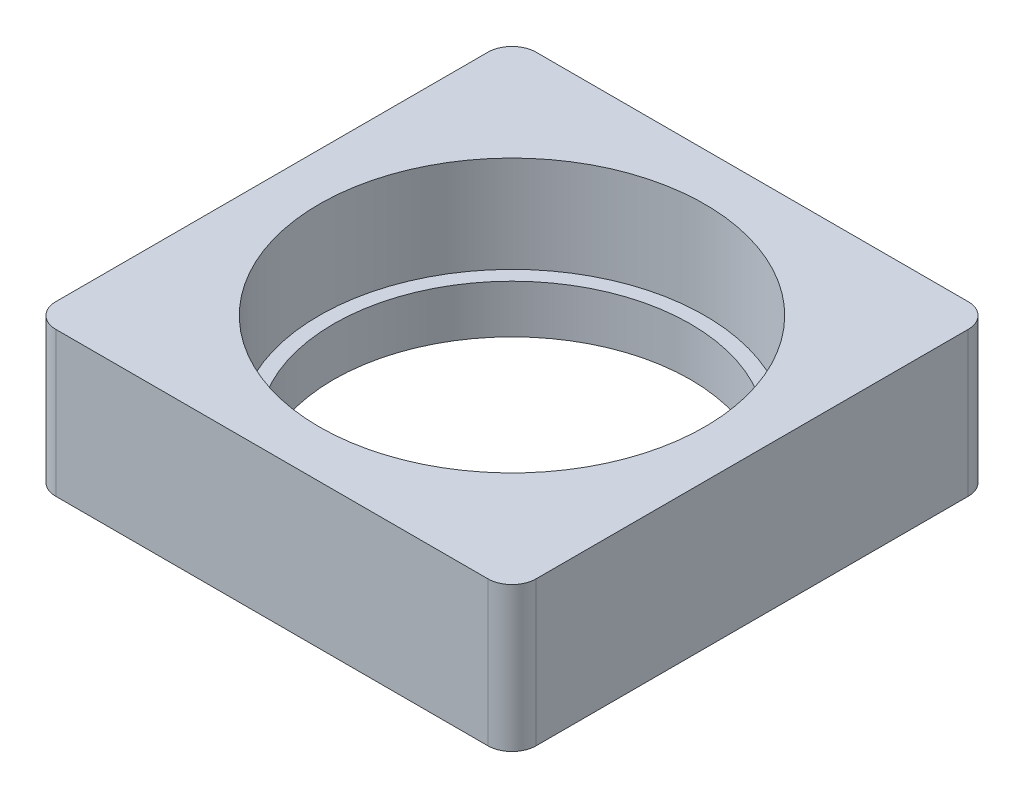
ISO-10303-21;
HEADER;
FILE_DESCRIPTION(('STEP AP214'),'2;1');
FILE_NAME('part.step','',(''),(''),'','','');
FILE_SCHEMA(('AUTOMOTIVE_DESIGN { 1 0 10303 214 1 1 1 1 }'));
ENDSEC;
DATA;
#1=APPLICATION_CONTEXT('core data for automotive mechanical design processes');
#2=APPLICATION_PROTOCOL_DEFINITION('international standard','automotive_design',2000,#1);
#3=PRODUCT_CONTEXT('',#1,'mechanical');
#4=PRODUCT('Part','Part','',(#3));
#5=PRODUCT_RELATED_PRODUCT_CATEGORY('part','',(#4));
#6=PRODUCT_DEFINITION_FORMATION('','',#4);
#7=PRODUCT_DEFINITION_CONTEXT('part definition',#1,'design');
#8=PRODUCT_DEFINITION('design','',#6,#7);
#9=PRODUCT_DEFINITION_SHAPE('','',#8);
#10=(LENGTH_UNIT() NAMED_UNIT(*) SI_UNIT(.MILLI.,.METRE.));
#11=(NAMED_UNIT(*) PLANE_ANGLE_UNIT() SI_UNIT($,.RADIAN.));
#12=(NAMED_UNIT(*) SI_UNIT($,.STERADIAN.) SOLID_ANGLE_UNIT());
#13=UNCERTAINTY_MEASURE_WITH_UNIT(LENGTH_MEASURE(1.E-05),#10,'distance_accuracy_value','');
#14=(GEOMETRIC_REPRESENTATION_CONTEXT(3) GLOBAL_UNCERTAINTY_ASSIGNED_CONTEXT((#13)) GLOBAL_UNIT_ASSIGNED_CONTEXT((#10,
#11,#12)) REPRESENTATION_CONTEXT('',''));
#15=CARTESIAN_POINT('',(0.,0.,0.));
#16=DIRECTION('',(0.,0.,1.));
#17=DIRECTION('',(1.,0.,0.));
#18=AXIS2_PLACEMENT_3D('',#15,#16,#17);
#19=CARTESIAN_POINT('',(1.5748,4.7625,-4.572));
#20=DIRECTION('',(-1.,0.,0.));
#21=DIRECTION('',(0.,0.,1.));
#22=AXIS2_PLACEMENT_3D('',#19,#20,#21);
#23=PLANE('',#22);
#24=CARTESIAN_POINT('',(1.5748,4.7625,-4.572));
#25=DIRECTION('',(-1.,0.,0.));
#26=DIRECTION('',(0.,0.,1.));
#27=AXIS2_PLACEMENT_3D('',#24,#25,#26);
#28=CIRCLE('',#27,3.1623);
#29=CARTESIAN_POINT('',(1.5748,4.7625,-1.4097));
#30=VERTEX_POINT('',#29);
#31=EDGE_CURVE('E236',#30,#30,#28,.T.);
#32=ORIENTED_EDGE('',*,*,#31,.T.);
#33=EDGE_LOOP('',(#32));
#34=FACE_BOUND('',#33,.T.);
#35=ADVANCED_FACE('F16',(#34),#23,.T.);
#36=CARTESIAN_POINT('',(15.8115,-35.9210244842766,-15.8115));
#37=DIRECTION('',(0.,1.,0.));
#38=DIRECTION('',(0.,0.,1.));
#39=AXIS2_PLACEMENT_3D('',#36,#37,#38);
#40=CYLINDRICAL_SURFACE('',#39,12.7);
#41=CARTESIAN_POINT('',(15.8115,3.175,-15.8115));
#42=DIRECTION('',(0.,1.,0.));
#43=DIRECTION('',(0.,0.,1.));
#44=AXIS2_PLACEMENT_3D('',#41,#42,#43);
#45=CIRCLE('',#44,12.7);
#46=CARTESIAN_POINT('',(15.8115,3.175,-3.1115));
#47=VERTEX_POINT('',#46);
#48=EDGE_CURVE('E19',#47,#47,#45,.F.);
#49=ORIENTED_EDGE('',*,*,#48,.T.);
#50=EDGE_LOOP('',(#49));
#51=FACE_BOUND('',#50,.T.);
#52=CARTESIAN_POINT('',(15.8115,9.525,-15.8115));
#53=DIRECTION('',(0.,1.,0.));
#54=DIRECTION('',(0.,0.,1.));
#55=AXIS2_PLACEMENT_3D('',#52,#53,#54);
#56=CIRCLE('',#55,12.7);
#57=CARTESIAN_POINT('',(15.8115,9.525,-3.1115));
#58=VERTEX_POINT('',#57);
#59=EDGE_CURVE('E238',#58,#58,#56,.T.);
#60=ORIENTED_EDGE('',*,*,#59,.T.);
#61=EDGE_LOOP('',(#60));
#62=FACE_BOUND('',#61,.T.);
#63=ADVANCED_FACE('F248',(#51,#62),#40,.F.);
#64=CARTESIAN_POINT('',(0.,3.175,0.));
#65=DIRECTION('',(0.,-1.,0.));
#66=DIRECTION('',(0.,0.,-1.));
#67=AXIS2_PLACEMENT_3D('',#64,#65,#66);
#68=PLANE('',#67);
#69=CARTESIAN_POINT('',(15.8115,3.175,-15.8115));
#70=DIRECTION('',(0.,1.,0.));
#71=DIRECTION('',(0.,0.,1.));
#72=AXIS2_PLACEMENT_3D('',#69,#70,#71);
#73=CIRCLE('',#72,11.7475);
#74=CARTESIAN_POINT('',(15.8115,3.175,-4.064));
#75=VERTEX_POINT('',#74);
#76=EDGE_CURVE('E122',#75,#75,#73,.F.);
#77=ORIENTED_EDGE('',*,*,#76,.T.);
#78=EDGE_LOOP('',(#77));
#79=FACE_BOUND('',#78,.T.);
#80=ORIENTED_EDGE('',*,*,#48,.F.);
#81=EDGE_LOOP('',(#80));
#82=FACE_BOUND('',#81,.T.);
#83=ADVANCED_FACE('F193',(#79,#82),#68,.F.);
#84=CARTESIAN_POINT('',(1.5748,4.7625,-4.572));
#85=DIRECTION('',(-1.,0.,0.));
#86=DIRECTION('',(0.,0.,1.));
#87=AXIS2_PLACEMENT_3D('',#84,#85,#86);
#88=CYLINDRICAL_SURFACE('',#87,3.1623);
#89=CARTESIAN_POINT('',(0.,4.7625,-4.572));
#90=DIRECTION('',(-1.,0.,0.));
#91=DIRECTION('',(0.,0.,1.));
#92=AXIS2_PLACEMENT_3D('',#89,#90,#91);
#93=CIRCLE('',#92,3.1623);
#94=CARTESIAN_POINT('',(0.,5.80791907386464,-1.5875));
#95=VERTEX_POINT('',#94);
#96=CARTESIAN_POINT('',(0.,3.71708092613536,-1.5875));
#97=VERTEX_POINT('',#96);
#98=EDGE_CURVE('E144',#95,#97,#93,.T.);
#99=ORIENTED_EDGE('',*,*,#98,.T.);
#100=CARTESIAN_POINT('',(0.,5.80791907386464,-1.5875));
#101=CARTESIAN_POINT('',(2.21469381864389E-06,5.76543072385641,-1.57261710446023));
#102=CARTESIAN_POINT('',(0.000208960677507276,5.72263085381354,-1.55864380412265));
#103=CARTESIAN_POINT('',(0.000897624958865748,5.63647642581595,-1.53253737760836));
#104=CARTESIAN_POINT('',(0.00137953822386666,5.59312187802019,-1.52040421778156));
#105=CARTESIAN_POINT('',(0.00303694623328012,5.46234767019402,-1.48680112376522));
#106=CARTESIAN_POINT('',(0.00442424096767263,5.374196644088,-1.4681202917167));
#107=CARTESIAN_POINT('',(0.00691701924513229,5.19908724564886,-1.43875921328412));
#108=CARTESIAN_POINT('',(0.00802923257560603,5.11216325983567,-1.42787208949064));
#109=CARTESIAN_POINT('',(0.00956457345174745,4.93770899313758,-1.4133448523383));
#110=CARTESIAN_POINT('',(0.00998776089574341,4.85017876561883,-1.4097041090317));
#111=CARTESIAN_POINT('',(0.00998868227418239,4.67509393769335,-1.40969589680216));
#112=CARTESIAN_POINT('',(0.0095661843419069,4.58753933718492,-1.41333042258415));
#113=CARTESIAN_POINT('',(0.00803156157409693,4.41303611404772,-1.42784925211999));
#114=CARTESIAN_POINT('',(0.00691937644476932,4.32608754507152,-1.43873418972509));
#115=CARTESIAN_POINT('',(0.00442614760161724,4.15092792044109,-1.46809500897624));
#116=CARTESIAN_POINT('',(0.0030383580623584,4.06275126975242,-1.48677794109248));
#117=CARTESIAN_POINT('',(0.00138023691170389,3.93193933726919,-1.52038736834083));
#118=CARTESIAN_POINT('',(0.00089809078376427,3.88857233703908,-1.53252316845373));
#119=CARTESIAN_POINT('',(0.000209078381713718,3.80239329523531,-1.55863592020701));
#120=CARTESIAN_POINT('',(2.21714094926195E-06,3.75958126382295,-1.57261290550673));
#121=CARTESIAN_POINT('',(0.,3.71708092613536,-1.5875));
#122=B_SPLINE_CURVE_WITH_KNOTS('',3,(#100,#101,#102,#103,#104,#105,#106,#107,#108,#109,#110,
#111,#112,#113,#114,#115,#116,#117,#118,#119,#120,#121),.UNSPECIFIED.,.F.,.F.,(4,2,2,2,2,2,2,2,
2,2,4),(0.,0.135035182475541,0.270067895305719,0.540067419621777,0.802603660730558,
1.06511707784674,1.32770247972674,1.59031084056897,1.8603865825587,1.99545738041359,
2.13053064788746),.UNSPECIFIED.);
#123=EDGE_CURVE('E120',#95,#97,#122,.T.);
#124=ORIENTED_EDGE('',*,*,#123,.F.);
#125=EDGE_LOOP('',(#99,#124));
#126=FACE_BOUND('',#125,.T.);
#127=ORIENTED_EDGE('',*,*,#31,.F.);
#128=EDGE_LOOP('',(#127));
#129=FACE_BOUND('',#128,.T.);
#130=ADVANCED_FACE('F157',(#126,#129),#88,.F.);
#131=CARTESIAN_POINT('',(0.,9.525,0.));
#132=DIRECTION('',(0.,-1.,0.));
#133=DIRECTION('',(0.,0.,-1.));
#134=AXIS2_PLACEMENT_3D('',#131,#132,#133);
#135=PLANE('',#134);
#136=CARTESIAN_POINT('',(30.0355,9.525,-30.0355));
#137=DIRECTION('',(0.,-1.,0.));
#138=DIRECTION('',(0.,0.,-1.));
#139=AXIS2_PLACEMENT_3D('',#136,#137,#138);
#140=CIRCLE('',#139,1.5875);
#141=CARTESIAN_POINT('',(30.0355,9.525,-31.623));
#142=VERTEX_POINT('',#141);
#143=CARTESIAN_POINT('',(31.623,9.525,-30.0355));
#144=VERTEX_POINT('',#143);
#145=EDGE_CURVE('E85',#142,#144,#140,.T.);
#146=ORIENTED_EDGE('',*,*,#145,.F.);
#147=DIRECTION('',(1.,0.,0.));
#148=VECTOR('',#147,1.);
#149=CARTESIAN_POINT('',(0.,9.525,-31.623));
#150=LINE('',#149,#148);
#151=CARTESIAN_POINT('',(1.5875,9.525,-31.623));
#152=VERTEX_POINT('',#151);
#153=EDGE_CURVE('E104',#142,#152,#150,.F.);
#154=ORIENTED_EDGE('',*,*,#153,.T.);
#155=CARTESIAN_POINT('',(1.5875,9.525,-30.0355));
#156=DIRECTION('',(0.,-1.,0.));
#157=DIRECTION('',(0.,0.,-1.));
#158=AXIS2_PLACEMENT_3D('',#155,#156,#157);
#159=CIRCLE('',#158,1.5875);
#160=CARTESIAN_POINT('',(0.,9.525,-30.0355));
#161=VERTEX_POINT('',#160);
#162=EDGE_CURVE('E139',#161,#152,#159,.T.);
#163=ORIENTED_EDGE('',*,*,#162,.F.);
#164=DIRECTION('',(0.,0.,-1.));
#165=VECTOR('',#164,1.);
#166=CARTESIAN_POINT('',(0.,9.525,0.));
#167=LINE('',#166,#165);
#168=CARTESIAN_POINT('',(0.,9.525,-1.5875));
#169=VERTEX_POINT('',#168);
#170=EDGE_CURVE('E117',#161,#169,#167,.F.);
#171=ORIENTED_EDGE('',*,*,#170,.T.);
#172=CARTESIAN_POINT('',(1.5875,9.525,-1.5875));
#173=DIRECTION('',(0.,-1.,0.));
#174=DIRECTION('',(0.,0.,-1.));
#175=AXIS2_PLACEMENT_3D('',#172,#173,#174);
#176=CIRCLE('',#175,1.5875);
#177=CARTESIAN_POINT('',(1.5875,9.525,0.));
#178=VERTEX_POINT('',#177);
#179=EDGE_CURVE('E148',#178,#169,#176,.T.);
#180=ORIENTED_EDGE('',*,*,#179,.F.);
#181=DIRECTION('',(-1.,0.,0.));
#182=VECTOR('',#181,1.);
#183=CARTESIAN_POINT('',(0.,9.525,0.));
#184=LINE('',#183,#182);
#185=CARTESIAN_POINT('',(30.0355,9.525,0.));
#186=VERTEX_POINT('',#185);
#187=EDGE_CURVE('E123',#178,#186,#184,.F.);
#188=ORIENTED_EDGE('',*,*,#187,.T.);
#189=CARTESIAN_POINT('',(30.0355,9.525,-1.5875));
#190=DIRECTION('',(0.,-1.,0.));
#191=DIRECTION('',(0.,0.,-1.));
#192=AXIS2_PLACEMENT_3D('',#189,#190,#191);
#193=CIRCLE('',#192,1.5875);
#194=CARTESIAN_POINT('',(31.623,9.525,-1.5875));
#195=VERTEX_POINT('',#194);
#196=EDGE_CURVE('E92',#195,#186,#193,.T.);
#197=ORIENTED_EDGE('',*,*,#196,.F.);
#198=DIRECTION('',(0.,0.,1.));
#199=VECTOR('',#198,1.);
#200=CARTESIAN_POINT('',(31.623,9.525,0.));
#201=LINE('',#200,#199);
#202=EDGE_CURVE('E88',#195,#144,#201,.F.);
#203=ORIENTED_EDGE('',*,*,#202,.T.);
#204=EDGE_LOOP('',(#146,#154,#163,#171,#180,#188,#197,#203));
#205=FACE_BOUND('',#204,.T.);
#206=ORIENTED_EDGE('',*,*,#59,.F.);
#207=EDGE_LOOP('',(#206));
#208=FACE_BOUND('',#207,.T.);
#209=ADVANCED_FACE('F89',(#205,#208),#135,.F.);
#210=CARTESIAN_POINT('',(15.8115,0.,-15.8115));
#211=DIRECTION('',(0.,1.,0.));
#212=DIRECTION('',(0.,0.,1.));
#213=AXIS2_PLACEMENT_3D('',#210,#211,#212);
#214=CYLINDRICAL_SURFACE('',#213,11.7475);
#215=ORIENTED_EDGE('',*,*,#76,.F.);
#216=EDGE_LOOP('',(#215));
#217=FACE_BOUND('',#216,.T.);
#218=CARTESIAN_POINT('',(15.8115,0.,-15.8115));
#219=DIRECTION('',(0.,1.,0.));
#220=DIRECTION('',(0.,0.,1.));
#221=AXIS2_PLACEMENT_3D('',#218,#219,#220);
#222=CIRCLE('',#221,11.7475);
#223=CARTESIAN_POINT('',(15.8115,0.,-4.064));
#224=VERTEX_POINT('',#223);
#225=EDGE_CURVE('E136',#224,#224,#222,.T.);
#226=ORIENTED_EDGE('',*,*,#225,.F.);
#227=EDGE_LOOP('',(#226));
#228=FACE_BOUND('',#227,.T.);
#229=ADVANCED_FACE('F184',(#217,#228),#214,.F.);
#230=CARTESIAN_POINT('',(0.,9.525,-31.623));
#231=DIRECTION('',(0.,0.,1.));
#232=DIRECTION('',(1.,0.,0.));
#233=AXIS2_PLACEMENT_3D('',#230,#231,#232);
#234=PLANE('',#233);
#235=DIRECTION('',(0.,-1.,0.));
#236=VECTOR('',#235,1.);
#237=CARTESIAN_POINT('',(30.0355,9.525,-31.623));
#238=LINE('',#237,#236);
#239=CARTESIAN_POINT('',(30.0355,0.,-31.623));
#240=VERTEX_POINT('',#239);
#241=EDGE_CURVE('E97',#240,#142,#238,.F.);
#242=ORIENTED_EDGE('',*,*,#241,.F.);
#243=DIRECTION('',(1.,0.,0.));
#244=VECTOR('',#243,1.);
#245=CARTESIAN_POINT('',(0.,0.,-31.623));
#246=LINE('',#245,#244);
#247=CARTESIAN_POINT('',(1.5875,0.,-31.623));
#248=VERTEX_POINT('',#247);
#249=EDGE_CURVE('E135',#248,#240,#246,.T.);
#250=ORIENTED_EDGE('',*,*,#249,.F.);
#251=DIRECTION('',(0.,-1.,0.));
#252=VECTOR('',#251,1.);
#253=CARTESIAN_POINT('',(1.5875,9.525,-31.623));
#254=LINE('',#253,#252);
#255=EDGE_CURVE('E142',#152,#248,#254,.T.);
#256=ORIENTED_EDGE('',*,*,#255,.F.);
#257=ORIENTED_EDGE('',*,*,#153,.F.);
#258=EDGE_LOOP('',(#242,#250,#256,#257));
#259=FACE_BOUND('',#258,.T.);
#260=ADVANCED_FACE('F181',(#259),#234,.F.);
#261=CARTESIAN_POINT('',(30.0355,9.525,-30.0355));
#262=DIRECTION('',(0.,-1.,0.));
#263=DIRECTION('',(0.,0.,-1.));
#264=AXIS2_PLACEMENT_3D('',#261,#262,#263);
#265=CYLINDRICAL_SURFACE('',#264,1.5875);
#266=CARTESIAN_POINT('',(30.0355,0.,-30.0355));
#267=DIRECTION('',(0.,-1.,0.));
#268=DIRECTION('',(0.,0.,-1.));
#269=AXIS2_PLACEMENT_3D('',#266,#267,#268);
#270=CIRCLE('',#269,1.5875);
#271=CARTESIAN_POINT('',(31.623,0.,-30.0355));
#272=VERTEX_POINT('',#271);
#273=EDGE_CURVE('E133',#240,#272,#270,.T.);
#274=ORIENTED_EDGE('',*,*,#273,.F.);
#275=ORIENTED_EDGE('',*,*,#241,.T.);
#276=ORIENTED_EDGE('',*,*,#145,.T.);
#277=DIRECTION('',(0.,1.,0.));
#278=VECTOR('',#277,1.);
#279=CARTESIAN_POINT('',(31.623,9.525,-30.0355));
#280=LINE('',#279,#278);
#281=EDGE_CURVE('E96',#144,#272,#280,.F.);
#282=ORIENTED_EDGE('',*,*,#281,.T.);
#283=EDGE_LOOP('',(#274,#275,#276,#282));
#284=FACE_BOUND('',#283,.T.);
#285=ADVANCED_FACE('F102',(#284),#265,.T.);
#286=CARTESIAN_POINT('',(31.623,9.525,0.));
#287=DIRECTION('',(-1.,0.,0.));
#288=DIRECTION('',(0.,0.,1.));
#289=AXIS2_PLACEMENT_3D('',#286,#287,#288);
#290=PLANE('',#289);
#291=ORIENTED_EDGE('',*,*,#281,.F.);
#292=ORIENTED_EDGE('',*,*,#202,.F.);
#293=DIRECTION('',(0.,-1.,0.));
#294=VECTOR('',#293,1.);
#295=CARTESIAN_POINT('',(31.623,9.525,-1.5875));
#296=LINE('',#295,#294);
#297=CARTESIAN_POINT('',(31.623,0.,-1.5875));
#298=VERTEX_POINT('',#297);
#299=EDGE_CURVE('E111',#298,#195,#296,.F.);
#300=ORIENTED_EDGE('',*,*,#299,.F.);
#301=DIRECTION('',(0.,0.,-1.));
#302=VECTOR('',#301,1.);
#303=CARTESIAN_POINT('',(31.623,0.,0.));
#304=LINE('',#303,#302);
#305=EDGE_CURVE('E108',#272,#298,#304,.F.);
#306=ORIENTED_EDGE('',*,*,#305,.F.);
#307=EDGE_LOOP('',(#291,#292,#300,#306));
#308=FACE_BOUND('',#307,.T.);
#309=ADVANCED_FACE('F106',(#308),#290,.F.);
#310=CARTESIAN_POINT('',(30.0355,9.525,-1.5875));
#311=DIRECTION('',(0.,-1.,0.));
#312=DIRECTION('',(0.,0.,-1.));
#313=AXIS2_PLACEMENT_3D('',#310,#311,#312);
#314=CYLINDRICAL_SURFACE('',#313,1.5875);
#315=CARTESIAN_POINT('',(30.0355,0.,-1.5875));
#316=DIRECTION('',(0.,-1.,0.));
#317=DIRECTION('',(0.,0.,-1.));
#318=AXIS2_PLACEMENT_3D('',#315,#316,#317);
#319=CIRCLE('',#318,1.5875);
#320=CARTESIAN_POINT('',(30.0355,0.,0.));
#321=VERTEX_POINT('',#320);
#322=EDGE_CURVE('E130',#298,#321,#319,.T.);
#323=ORIENTED_EDGE('',*,*,#322,.F.);
#324=ORIENTED_EDGE('',*,*,#299,.T.);
#325=ORIENTED_EDGE('',*,*,#196,.T.);
#326=DIRECTION('',(0.,1.,0.));
#327=VECTOR('',#326,1.);
#328=CARTESIAN_POINT('',(30.0355,9.525,0.));
#329=LINE('',#328,#327);
#330=EDGE_CURVE('E124',#186,#321,#329,.F.);
#331=ORIENTED_EDGE('',*,*,#330,.T.);
#332=EDGE_LOOP('',(#323,#324,#325,#331));
#333=FACE_BOUND('',#332,.T.);
#334=ADVANCED_FACE('F172',(#333),#314,.T.);
#335=CARTESIAN_POINT('',(0.,9.525,0.));
#336=DIRECTION('',(0.,0.,-1.));
#337=DIRECTION('',(-1.,0.,0.));
#338=AXIS2_PLACEMENT_3D('',#335,#336,#337);
#339=PLANE('',#338);
#340=ORIENTED_EDGE('',*,*,#330,.F.);
#341=ORIENTED_EDGE('',*,*,#187,.F.);
#342=DIRECTION('',(0.,-1.,0.));
#343=VECTOR('',#342,1.);
#344=CARTESIAN_POINT('',(1.5875,9.525,0.));
#345=LINE('',#344,#343);
#346=CARTESIAN_POINT('',(1.5875,0.,0.));
#347=VERTEX_POINT('',#346);
#348=EDGE_CURVE('E223',#347,#178,#345,.F.);
#349=ORIENTED_EDGE('',*,*,#348,.F.);
#350=DIRECTION('',(1.,0.,0.));
#351=VECTOR('',#350,1.);
#352=CARTESIAN_POINT('',(0.,0.,0.));
#353=LINE('',#352,#351);
#354=EDGE_CURVE('E129',#321,#347,#353,.F.);
#355=ORIENTED_EDGE('',*,*,#354,.F.);
#356=EDGE_LOOP('',(#340,#341,#349,#355));
#357=FACE_BOUND('',#356,.T.);
#358=ADVANCED_FACE('F167',(#357),#339,.F.);
#359=CARTESIAN_POINT('',(1.5875,9.525,-1.5875));
#360=DIRECTION('',(0.,-1.,0.));
#361=DIRECTION('',(0.,0.,-1.));
#362=AXIS2_PLACEMENT_3D('',#359,#360,#361);
#363=CYLINDRICAL_SURFACE('',#362,1.5875);
#364=DIRECTION('',(0.,1.,0.));
#365=VECTOR('',#364,1.);
#366=CARTESIAN_POINT('',(0.,9.525,-1.5875));
#367=LINE('',#366,#365);
#368=EDGE_CURVE('E119',#169,#95,#367,.F.);
#369=ORIENTED_EDGE('',*,*,#368,.T.);
#370=ORIENTED_EDGE('',*,*,#123,.T.);
#371=DIRECTION('',(0.,1.,0.));
#372=VECTOR('',#371,1.);
#373=CARTESIAN_POINT('',(0.,9.525,-1.5875));
#374=LINE('',#373,#372);
#375=CARTESIAN_POINT('',(0.,0.,-1.5875));
#376=VERTEX_POINT('',#375);
#377=EDGE_CURVE('E143',#97,#376,#374,.F.);
#378=ORIENTED_EDGE('',*,*,#377,.T.);
#379=CARTESIAN_POINT('',(1.5875,0.,-1.5875));
#380=DIRECTION('',(0.,-1.,0.));
#381=DIRECTION('',(0.,0.,-1.));
#382=AXIS2_PLACEMENT_3D('',#379,#380,#381);
#383=CIRCLE('',#382,1.5875);
#384=EDGE_CURVE('E126',#347,#376,#383,.T.);
#385=ORIENTED_EDGE('',*,*,#384,.F.);
#386=ORIENTED_EDGE('',*,*,#348,.T.);
#387=ORIENTED_EDGE('',*,*,#179,.T.);
#388=EDGE_LOOP('',(#369,#370,#378,#385,#386,#387));
#389=FACE_BOUND('',#388,.T.);
#390=ADVANCED_FACE('F161',(#389),#363,.T.);
#391=CARTESIAN_POINT('',(0.,9.525,0.));
#392=DIRECTION('',(1.,0.,0.));
#393=DIRECTION('',(0.,0.,-1.));
#394=AXIS2_PLACEMENT_3D('',#391,#392,#393);
#395=PLANE('',#394);
#396=ORIENTED_EDGE('',*,*,#98,.F.);
#397=ORIENTED_EDGE('',*,*,#368,.F.);
#398=ORIENTED_EDGE('',*,*,#170,.F.);
#399=DIRECTION('',(0.,-1.,0.));
#400=VECTOR('',#399,1.);
#401=CARTESIAN_POINT('',(0.,9.525,-30.0355));
#402=LINE('',#401,#400);
#403=CARTESIAN_POINT('',(0.,0.,-30.0355));
#404=VERTEX_POINT('',#403);
#405=EDGE_CURVE('E34',#404,#161,#402,.F.);
#406=ORIENTED_EDGE('',*,*,#405,.F.);
#407=DIRECTION('',(0.,0.,-1.));
#408=VECTOR('',#407,1.);
#409=CARTESIAN_POINT('',(0.,0.,0.));
#410=LINE('',#409,#408);
#411=EDGE_CURVE('E25',#376,#404,#410,.T.);
#412=ORIENTED_EDGE('',*,*,#411,.F.);
#413=ORIENTED_EDGE('',*,*,#377,.F.);
#414=EDGE_LOOP('',(#396,#397,#398,#406,#412,#413));
#415=FACE_BOUND('',#414,.T.);
#416=ADVANCED_FACE('F166',(#415),#395,.F.);
#417=CARTESIAN_POINT('',(1.5875,9.525,-30.0355));
#418=DIRECTION('',(0.,-1.,0.));
#419=DIRECTION('',(0.,0.,-1.));
#420=AXIS2_PLACEMENT_3D('',#417,#418,#419);
#421=CYLINDRICAL_SURFACE('',#420,1.5875);
#422=CARTESIAN_POINT('',(1.5875,0.,-30.0355));
#423=DIRECTION('',(0.,-1.,0.));
#424=DIRECTION('',(0.,0.,-1.));
#425=AXIS2_PLACEMENT_3D('',#422,#423,#424);
#426=CIRCLE('',#425,1.5875);
#427=EDGE_CURVE('E11',#404,#248,#426,.T.);
#428=ORIENTED_EDGE('',*,*,#427,.F.);
#429=ORIENTED_EDGE('',*,*,#405,.T.);
#430=ORIENTED_EDGE('',*,*,#162,.T.);
#431=ORIENTED_EDGE('',*,*,#255,.T.);
#432=EDGE_LOOP('',(#428,#429,#430,#431));
#433=FACE_BOUND('',#432,.T.);
#434=ADVANCED_FACE('F197',(#433),#421,.T.);
#435=CARTESIAN_POINT('',(0.,0.,0.));
#436=DIRECTION('',(0.,-1.,0.));
#437=DIRECTION('',(0.,0.,-1.));
#438=AXIS2_PLACEMENT_3D('',#435,#436,#437);
#439=PLANE('',#438);
#440=ORIENTED_EDGE('',*,*,#411,.T.);
#441=ORIENTED_EDGE('',*,*,#427,.T.);
#442=ORIENTED_EDGE('',*,*,#249,.T.);
#443=ORIENTED_EDGE('',*,*,#273,.T.);
#444=ORIENTED_EDGE('',*,*,#305,.T.);
#445=ORIENTED_EDGE('',*,*,#322,.T.);
#446=ORIENTED_EDGE('',*,*,#354,.T.);
#447=ORIENTED_EDGE('',*,*,#384,.T.);
#448=EDGE_LOOP('',(#440,#441,#442,#443,#444,#445,#446,#447));
#449=FACE_BOUND('',#448,.T.);
#450=ORIENTED_EDGE('',*,*,#225,.T.);
#451=EDGE_LOOP('',(#450));
#452=FACE_BOUND('',#451,.T.);
#453=ADVANCED_FACE('F195',(#449,#452),#439,.T.);
#454=CLOSED_SHELL('',(#35,#63,#83,#130,#209,#229,#260,#285,#309,#334,#358,#390,#416,#434,#453));
#455=MANIFOLD_SOLID_BREP('B1',#454);
#456=ADVANCED_BREP_SHAPE_REPRESENTATION('',(#18,#455),#14);
#457=SHAPE_DEFINITION_REPRESENTATION(#9,#456);
ENDSEC;
END-ISO-10303-21;
